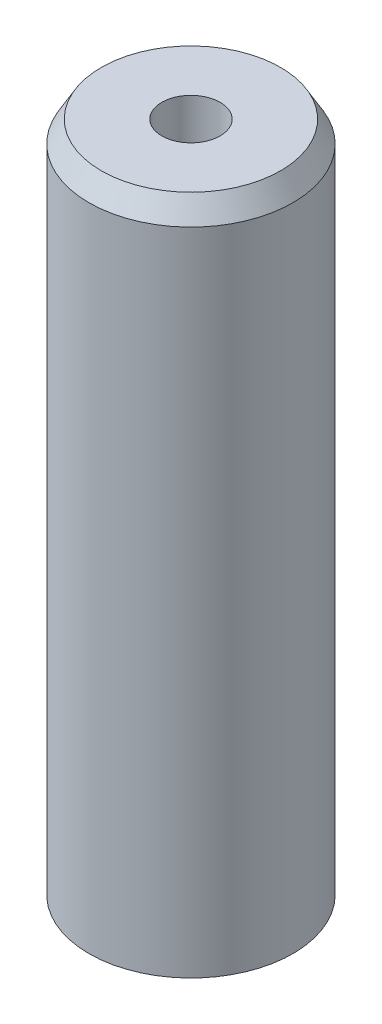
ISO-10303-21;
HEADER;
FILE_DESCRIPTION(('STEP AP214'),'2;1');
FILE_NAME('part.step','',(''),(''),'','','');
FILE_SCHEMA(('AUTOMOTIVE_DESIGN { 1 0 10303 214 1 1 1 1 }'));
ENDSEC;
DATA;
#1=APPLICATION_CONTEXT('core data for automotive mechanical design processes');
#2=APPLICATION_PROTOCOL_DEFINITION('international standard','automotive_design',2000,#1);
#3=PRODUCT_CONTEXT('',#1,'mechanical');
#4=PRODUCT('Part','Part','',(#3));
#5=PRODUCT_RELATED_PRODUCT_CATEGORY('part','',(#4));
#6=PRODUCT_DEFINITION_FORMATION('','',#4);
#7=PRODUCT_DEFINITION_CONTEXT('part definition',#1,'design');
#8=PRODUCT_DEFINITION('design','',#6,#7);
#9=PRODUCT_DEFINITION_SHAPE('','',#8);
#10=(LENGTH_UNIT() NAMED_UNIT(*) SI_UNIT(.MILLI.,.METRE.));
#11=(NAMED_UNIT(*) PLANE_ANGLE_UNIT() SI_UNIT($,.RADIAN.));
#12=(NAMED_UNIT(*) SI_UNIT($,.STERADIAN.) SOLID_ANGLE_UNIT());
#13=UNCERTAINTY_MEASURE_WITH_UNIT(LENGTH_MEASURE(1.E-05),#10,'distance_accuracy_value','');
#14=(GEOMETRIC_REPRESENTATION_CONTEXT(3) GLOBAL_UNCERTAINTY_ASSIGNED_CONTEXT((#13)) GLOBAL_UNIT_ASSIGNED_CONTEXT((#10,
#11,#12)) REPRESENTATION_CONTEXT('',''));
#15=CARTESIAN_POINT('',(0.,0.,0.));
#16=DIRECTION('',(0.,0.,1.));
#17=DIRECTION('',(1.,0.,0.));
#18=AXIS2_PLACEMENT_3D('',#15,#16,#17);
#19=CARTESIAN_POINT('',(0.,67.0809140296957,0.));
#20=DIRECTION('',(0.,-1.,0.));
#21=DIRECTION('',(0.,0.,-1.));
#22=AXIS2_PLACEMENT_3D('',#19,#20,#21);
#23=CYLINDRICAL_SURFACE('',#22,10.);
#24=CARTESIAN_POINT('',(0.,64.9782930579519,0.));
#25=DIRECTION('',(0.,1.,0.));
#26=DIRECTION('',(0.,0.,1.));
#27=AXIS2_PLACEMENT_3D('',#24,#25,#26);
#28=CIRCLE('',#27,10.);
#29=CARTESIAN_POINT('',(0.,64.9782930579519,10.));
#30=VERTEX_POINT('',#29);
#31=EDGE_CURVE('E50',#30,#30,#28,.F.);
#32=ORIENTED_EDGE('',*,*,#31,.T.);
#33=EDGE_LOOP('',(#32));
#34=FACE_BOUND('',#33,.T.);
#35=CARTESIAN_POINT('',(0.,1.21394878404003,0.));
#36=DIRECTION('',(0.,1.,0.));
#37=DIRECTION('',(0.,0.,1.));
#38=AXIS2_PLACEMENT_3D('',#35,#36,#37);
#39=CIRCLE('',#38,10.);
#40=CARTESIAN_POINT('',(0.,1.21394878404003,10.));
#41=VERTEX_POINT('',#40);
#42=EDGE_CURVE('E51',#41,#41,#39,.T.);
#43=ORIENTED_EDGE('',*,*,#42,.T.);
#44=EDGE_LOOP('',(#43));
#45=FACE_BOUND('',#44,.T.);
#46=ADVANCED_FACE('F39',(#34,#45),#23,.T.);
#47=CARTESIAN_POINT('',(0.,67.0809140296957,0.));
#48=DIRECTION('',(0.,1.,0.));
#49=DIRECTION('',(0.,0.,1.));
#50=AXIS2_PLACEMENT_3D('',#47,#48,#49);
#51=PLANE('',#50);
#52=CARTESIAN_POINT('',(0.,67.0809140296957,0.));
#53=DIRECTION('',(0.,1.,0.));
#54=DIRECTION('',(0.,0.,1.));
#55=AXIS2_PLACEMENT_3D('',#52,#53,#54);
#56=CIRCLE('',#55,8.78605121595995);
#57=CARTESIAN_POINT('',(0.,67.0809140296957,8.78605121595995));
#58=VERTEX_POINT('',#57);
#59=EDGE_CURVE('E54',#58,#58,#56,.T.);
#60=ORIENTED_EDGE('',*,*,#59,.T.);
#61=EDGE_LOOP('',(#60));
#62=FACE_BOUND('',#61,.T.);
#63=CARTESIAN_POINT('',(0.,67.0809140296957,0.));
#64=DIRECTION('',(0.,1.,0.));
#65=DIRECTION('',(0.,0.,1.));
#66=AXIS2_PLACEMENT_3D('',#63,#64,#65);
#67=CIRCLE('',#66,2.85786736825295);
#68=CARTESIAN_POINT('',(0.,67.0809140296957,2.85786736825295));
#69=VERTEX_POINT('',#68);
#70=EDGE_CURVE('E58',#69,#69,#67,.T.);
#71=ORIENTED_EDGE('',*,*,#70,.F.);
#72=EDGE_LOOP('',(#71));
#73=FACE_BOUND('',#72,.T.);
#74=ADVANCED_FACE('F69',(#62,#73),#51,.T.);
#75=CARTESIAN_POINT('',(0.,0.,0.));
#76=DIRECTION('',(0.,1.,0.));
#77=DIRECTION('',(0.,0.,1.));
#78=AXIS2_PLACEMENT_3D('',#75,#76,#77);
#79=PLANE('',#78);
#80=CARTESIAN_POINT('',(0.,0.,0.));
#81=DIRECTION('',(0.,1.,0.));
#82=DIRECTION('',(0.,0.,1.));
#83=AXIS2_PLACEMENT_3D('',#80,#81,#82);
#84=CIRCLE('',#83,7.89737902825618);
#85=CARTESIAN_POINT('',(0.,0.,7.89737902825618));
#86=VERTEX_POINT('',#85);
#87=EDGE_CURVE('E10',#86,#86,#84,.F.);
#88=ORIENTED_EDGE('',*,*,#87,.T.);
#89=EDGE_LOOP('',(#88));
#90=FACE_BOUND('',#89,.T.);
#91=CARTESIAN_POINT('',(0.,0.,0.));
#92=DIRECTION('',(0.,1.,0.));
#93=DIRECTION('',(0.,0.,1.));
#94=AXIS2_PLACEMENT_3D('',#91,#92,#93);
#95=CIRCLE('',#94,2.85786736825295);
#96=CARTESIAN_POINT('',(0.,0.,2.85786736825295));
#97=VERTEX_POINT('',#96);
#98=EDGE_CURVE('E63',#97,#97,#95,.T.);
#99=ORIENTED_EDGE('',*,*,#98,.T.);
#100=EDGE_LOOP('',(#99));
#101=FACE_BOUND('',#100,.T.);
#102=ADVANCED_FACE('F75',(#90,#101),#79,.F.);
#103=CARTESIAN_POINT('',(0.,67.0809140296957,0.));
#104=DIRECTION('',(0.,-1.,0.));
#105=DIRECTION('',(0.,0.,-1.));
#106=AXIS2_PLACEMENT_3D('',#103,#104,#105);
#107=CYLINDRICAL_SURFACE('',#106,2.85786736825295);
#108=ORIENTED_EDGE('',*,*,#70,.T.);
#109=EDGE_LOOP('',(#108));
#110=FACE_BOUND('',#109,.T.);
#111=ORIENTED_EDGE('',*,*,#98,.F.);
#112=EDGE_LOOP('',(#111));
#113=FACE_BOUND('',#112,.T.);
#114=ADVANCED_FACE('F70',(#110,#113),#107,.F.);
#115=CARTESIAN_POINT('',(0.,67.0809140296957,0.));
#116=DIRECTION('',(0.,-1.,0.));
#117=DIRECTION('',(0.,0.,-1.));
#118=AXIS2_PLACEMENT_3D('',#115,#116,#117);
#119=CONICAL_SURFACE('',#118,8.78605121595995,0.523598775598297);
#120=ORIENTED_EDGE('',*,*,#31,.F.);
#121=EDGE_LOOP('',(#120));
#122=FACE_BOUND('',#121,.T.);
#123=ORIENTED_EDGE('',*,*,#59,.F.);
#124=EDGE_LOOP('',(#123));
#125=FACE_BOUND('',#124,.T.);
#126=ADVANCED_FACE('F81',(#122,#125),#119,.T.);
#127=CARTESIAN_POINT('',(0.,1.21394878404003,0.));
#128=DIRECTION('',(0.,1.,0.));
#129=DIRECTION('',(0.,0.,1.));
#130=AXIS2_PLACEMENT_3D('',#127,#128,#129);
#131=CONICAL_SURFACE('',#130,10.,1.0471975511966);
#132=ORIENTED_EDGE('',*,*,#87,.F.);
#133=EDGE_LOOP('',(#132));
#134=FACE_BOUND('',#133,.T.);
#135=ORIENTED_EDGE('',*,*,#42,.F.);
#136=EDGE_LOOP('',(#135));
#137=FACE_BOUND('',#136,.T.);
#138=ADVANCED_FACE('F45',(#134,#137),#131,.T.);
#139=CLOSED_SHELL('',(#46,#74,#102,#114,#126,#138));
#140=MANIFOLD_SOLID_BREP('B2',#139);
#141=ADVANCED_BREP_SHAPE_REPRESENTATION('',(#18,#140),#14);
#142=SHAPE_DEFINITION_REPRESENTATION(#9,#141);
ENDSEC;
END-ISO-10303-21;
